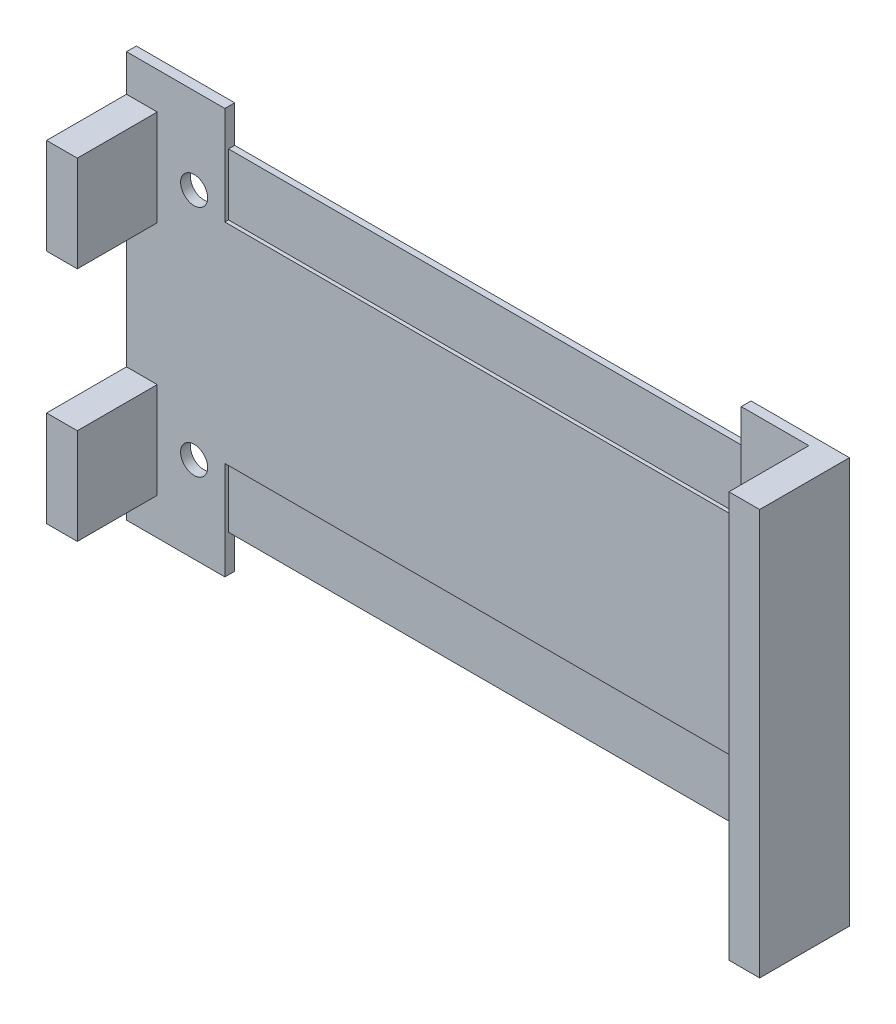
ISO-10303-21;
HEADER;
FILE_DESCRIPTION(('STEP AP214'),'2;1');
FILE_NAME('part.step','',(''),(''),'','','');
FILE_SCHEMA(('AUTOMOTIVE_DESIGN { 1 0 10303 214 1 1 1 1 }'));
ENDSEC;
DATA;
#1=APPLICATION_CONTEXT('core data for automotive mechanical design processes');
#2=APPLICATION_PROTOCOL_DEFINITION('international standard','automotive_design',2000,#1);
#3=PRODUCT_CONTEXT('',#1,'mechanical');
#4=PRODUCT('Part','Part','',(#3));
#5=PRODUCT_RELATED_PRODUCT_CATEGORY('part','',(#4));
#6=PRODUCT_DEFINITION_FORMATION('','',#4);
#7=PRODUCT_DEFINITION_CONTEXT('part definition',#1,'design');
#8=PRODUCT_DEFINITION('design','',#6,#7);
#9=PRODUCT_DEFINITION_SHAPE('','',#8);
#10=(LENGTH_UNIT() NAMED_UNIT(*) SI_UNIT(.MILLI.,.METRE.));
#11=(NAMED_UNIT(*) PLANE_ANGLE_UNIT() SI_UNIT($,.RADIAN.));
#12=(NAMED_UNIT(*) SI_UNIT($,.STERADIAN.) SOLID_ANGLE_UNIT());
#13=UNCERTAINTY_MEASURE_WITH_UNIT(LENGTH_MEASURE(1.E-05),#10,'distance_accuracy_value','');
#14=(GEOMETRIC_REPRESENTATION_CONTEXT(3) GLOBAL_UNCERTAINTY_ASSIGNED_CONTEXT((#13)) GLOBAL_UNIT_ASSIGNED_CONTEXT((#10,
#11,#12)) REPRESENTATION_CONTEXT('',''));
#15=CARTESIAN_POINT('',(0.,0.,0.));
#16=DIRECTION('',(0.,0.,1.));
#17=DIRECTION('',(1.,0.,0.));
#18=AXIS2_PLACEMENT_3D('',#15,#16,#17);
#19=CARTESIAN_POINT('',(0.,0.,-1.5));
#20=DIRECTION('',(0.,0.,-1.));
#21=DIRECTION('',(-1.,0.,0.));
#22=AXIS2_PLACEMENT_3D('',#19,#20,#21);
#23=PLANE('',#22);
#24=CARTESIAN_POINT('',(2.5,21.,-1.5));
#25=DIRECTION('',(0.,0.,1.));
#26=DIRECTION('',(1.,0.,0.));
#27=AXIS2_PLACEMENT_3D('',#24,#25,#26);
#28=CIRCLE('',#27,1.1);
#29=CARTESIAN_POINT('',(3.6,21.,-1.5));
#30=VERTEX_POINT('',#29);
#31=EDGE_CURVE('E385',#30,#30,#28,.T.);
#32=ORIENTED_EDGE('',*,*,#31,.F.);
#33=EDGE_LOOP('',(#32));
#34=FACE_BOUND('',#33,.T.);
#35=CARTESIAN_POINT('',(49.5,21.,-1.5));
#36=DIRECTION('',(0.,0.,1.));
#37=DIRECTION('',(1.,0.,0.));
#38=AXIS2_PLACEMENT_3D('',#35,#36,#37);
#39=CIRCLE('',#38,1.1);
#40=CARTESIAN_POINT('',(50.6,21.,-1.5));
#41=VERTEX_POINT('',#40);
#42=EDGE_CURVE('E401',#41,#41,#39,.T.);
#43=ORIENTED_EDGE('',*,*,#42,.F.);
#44=EDGE_LOOP('',(#43));
#45=FACE_BOUND('',#44,.T.);
#46=CARTESIAN_POINT('',(49.5,2.,-1.5));
#47=DIRECTION('',(0.,0.,1.));
#48=DIRECTION('',(1.,0.,0.));
#49=AXIS2_PLACEMENT_3D('',#46,#47,#48);
#50=CIRCLE('',#49,1.1);
#51=CARTESIAN_POINT('',(50.6,2.,-1.5));
#52=VERTEX_POINT('',#51);
#53=EDGE_CURVE('E409',#52,#52,#50,.T.);
#54=ORIENTED_EDGE('',*,*,#53,.F.);
#55=EDGE_LOOP('',(#54));
#56=FACE_BOUND('',#55,.T.);
#57=CARTESIAN_POINT('',(2.5,2.,-1.5));
#58=DIRECTION('',(0.,0.,1.));
#59=DIRECTION('',(1.,0.,0.));
#60=AXIS2_PLACEMENT_3D('',#57,#58,#59);
#61=CIRCLE('',#60,1.1);
#62=CARTESIAN_POINT('',(3.6,2.,-1.5));
#63=VERTEX_POINT('',#62);
#64=EDGE_CURVE('E393',#63,#63,#61,.T.);
#65=ORIENTED_EDGE('',*,*,#64,.F.);
#66=EDGE_LOOP('',(#65));
#67=FACE_BOUND('',#66,.T.);
#68=DIRECTION('',(1.,0.,0.));
#69=VECTOR('',#68,1.);
#70=CARTESIAN_POINT('',(-3.,17.2,-1.5));
#71=LINE('',#70,#69);
#72=CARTESIAN_POINT('',(-3.,17.2,-1.5));
#73=VERTEX_POINT('',#72);
#74=CARTESIAN_POINT('',(-0.5,17.2,-1.5));
#75=VERTEX_POINT('',#74);
#76=EDGE_CURVE('E547',#73,#75,#71,.T.);
#77=ORIENTED_EDGE('',*,*,#76,.F.);
#78=DIRECTION('',(0.,-1.,0.));
#79=VECTOR('',#78,1.);
#80=CARTESIAN_POINT('',(-3.,-5.,-1.5));
#81=LINE('',#80,#79);
#82=CARTESIAN_POINT('',(-3.,5.79999999999999,-1.5));
#83=VERTEX_POINT('',#82);
#84=EDGE_CURVE('E262',#73,#83,#81,.T.);
#85=ORIENTED_EDGE('',*,*,#84,.T.);
#86=DIRECTION('',(-1.,0.,0.));
#87=VECTOR('',#86,1.);
#88=CARTESIAN_POINT('',(-3.,5.79999999999999,-1.5));
#89=LINE('',#88,#87);
#90=CARTESIAN_POINT('',(-0.5,5.79999999999999,-1.5));
#91=VERTEX_POINT('',#90);
#92=EDGE_CURVE('E280',#91,#83,#89,.T.);
#93=ORIENTED_EDGE('',*,*,#92,.F.);
#94=DIRECTION('',(0.,1.,0.));
#95=VECTOR('',#94,1.);
#96=CARTESIAN_POINT('',(-0.5,-2.,-1.5));
#97=LINE('',#96,#95);
#98=CARTESIAN_POINT('',(-0.5,-2.,-1.5));
#99=VERTEX_POINT('',#98);
#100=EDGE_CURVE('E268',#99,#91,#97,.T.);
#101=ORIENTED_EDGE('',*,*,#100,.F.);
#102=DIRECTION('',(1.,0.,0.));
#103=VECTOR('',#102,1.);
#104=CARTESIAN_POINT('',(-3.,-2.,-1.5));
#105=LINE('',#104,#103);
#106=CARTESIAN_POINT('',(-3.,-2.,-1.5));
#107=VERTEX_POINT('',#106);
#108=EDGE_CURVE('E264',#107,#99,#105,.T.);
#109=ORIENTED_EDGE('',*,*,#108,.F.);
#110=CARTESIAN_POINT('',(-3.,-5.,-1.5));
#111=VERTEX_POINT('',#110);
#112=EDGE_CURVE('E419',#107,#111,#81,.T.);
#113=ORIENTED_EDGE('',*,*,#112,.T.);
#114=DIRECTION('',(1.,0.,0.));
#115=VECTOR('',#114,1.);
#116=CARTESIAN_POINT('',(0.,-5.,-1.5));
#117=LINE('',#116,#115);
#118=CARTESIAN_POINT('',(5.,-5.,-1.5));
#119=VERTEX_POINT('',#118);
#120=EDGE_CURVE('E424',#111,#119,#117,.T.);
#121=ORIENTED_EDGE('',*,*,#120,.T.);
#122=DIRECTION('',(0.,1.,0.));
#123=VECTOR('',#122,1.);
#124=CARTESIAN_POINT('',(5.,-5.,-1.5));
#125=LINE('',#124,#123);
#126=CARTESIAN_POINT('',(5.,2.99999999999999,-1.5));
#127=VERTEX_POINT('',#126);
#128=EDGE_CURVE('E426',#119,#127,#125,.T.);
#129=ORIENTED_EDGE('',*,*,#128,.T.);
#130=DIRECTION('',(1.,0.,0.));
#131=VECTOR('',#130,1.);
#132=CARTESIAN_POINT('',(47.,3.,-1.5));
#133=LINE('',#132,#131);
#134=CARTESIAN_POINT('',(47.,3.,-1.5));
#135=VERTEX_POINT('',#134);
#136=EDGE_CURVE('E428',#127,#135,#133,.T.);
#137=ORIENTED_EDGE('',*,*,#136,.T.);
#138=DIRECTION('',(0.,-1.,0.));
#139=VECTOR('',#138,1.);
#140=CARTESIAN_POINT('',(47.,-5.,-1.5));
#141=LINE('',#140,#139);
#142=CARTESIAN_POINT('',(47.,-5.,-1.5));
#143=VERTEX_POINT('',#142);
#144=EDGE_CURVE('E431',#135,#143,#141,.T.);
#145=ORIENTED_EDGE('',*,*,#144,.T.);
#146=DIRECTION('',(1.,0.,0.));
#147=VECTOR('',#146,1.);
#148=CARTESIAN_POINT('',(47.,-5.,-1.5));
#149=LINE('',#148,#147);
#150=CARTESIAN_POINT('',(52.5,-5.,-1.5));
#151=VERTEX_POINT('',#150);
#152=EDGE_CURVE('E433',#143,#151,#149,.T.);
#153=ORIENTED_EDGE('',*,*,#152,.T.);
#154=DIRECTION('',(0.,-1.,0.));
#155=VECTOR('',#154,1.);
#156=CARTESIAN_POINT('',(52.5,-5.,-1.5));
#157=LINE('',#156,#155);
#158=CARTESIAN_POINT('',(52.5,28.,-1.5));
#159=VERTEX_POINT('',#158);
#160=EDGE_CURVE('E309',#159,#151,#157,.T.);
#161=ORIENTED_EDGE('',*,*,#160,.F.);
#162=DIRECTION('',(-1.,0.,0.));
#163=VECTOR('',#162,1.);
#164=CARTESIAN_POINT('',(55.,28.,-1.5));
#165=LINE('',#164,#163);
#166=CARTESIAN_POINT('',(47.,28.,-1.5));
#167=VERTEX_POINT('',#166);
#168=EDGE_CURVE('E333',#159,#167,#165,.T.);
#169=ORIENTED_EDGE('',*,*,#168,.T.);
#170=DIRECTION('',(0.,-1.,0.));
#171=VECTOR('',#170,1.);
#172=CARTESIAN_POINT('',(47.,28.,-1.5));
#173=LINE('',#172,#171);
#174=CARTESIAN_POINT('',(47.,20.,-1.5));
#175=VERTEX_POINT('',#174);
#176=EDGE_CURVE('E504',#167,#175,#173,.T.);
#177=ORIENTED_EDGE('',*,*,#176,.T.);
#178=DIRECTION('',(-1.,0.,0.));
#179=VECTOR('',#178,1.);
#180=CARTESIAN_POINT('',(5.00000000000001,20.,-1.5));
#181=LINE('',#180,#179);
#182=CARTESIAN_POINT('',(5.00000000000001,20.,-1.5));
#183=VERTEX_POINT('',#182);
#184=EDGE_CURVE('E502',#175,#183,#181,.T.);
#185=ORIENTED_EDGE('',*,*,#184,.T.);
#186=DIRECTION('',(0.,1.,0.));
#187=VECTOR('',#186,1.);
#188=CARTESIAN_POINT('',(5.,28.,-1.5));
#189=LINE('',#188,#187);
#190=CARTESIAN_POINT('',(5.,28.,-1.5));
#191=VERTEX_POINT('',#190);
#192=EDGE_CURVE('E473',#183,#191,#189,.T.);
#193=ORIENTED_EDGE('',*,*,#192,.T.);
#194=DIRECTION('',(-1.,0.,0.));
#195=VECTOR('',#194,1.);
#196=CARTESIAN_POINT('',(-3.,28.,-1.5));
#197=LINE('',#196,#195);
#198=CARTESIAN_POINT('',(-3.,28.,-1.5));
#199=VERTEX_POINT('',#198);
#200=EDGE_CURVE('E415',#191,#199,#197,.T.);
#201=ORIENTED_EDGE('',*,*,#200,.T.);
#202=CARTESIAN_POINT('',(-3.,25.,-1.5));
#203=VERTEX_POINT('',#202);
#204=EDGE_CURVE('E421',#199,#203,#81,.T.);
#205=ORIENTED_EDGE('',*,*,#204,.T.);
#206=DIRECTION('',(-1.,0.,0.));
#207=VECTOR('',#206,1.);
#208=CARTESIAN_POINT('',(-3.,25.,-1.5));
#209=LINE('',#208,#207);
#210=CARTESIAN_POINT('',(-0.5,25.,-1.5));
#211=VERTEX_POINT('',#210);
#212=EDGE_CURVE('E66',#211,#203,#209,.T.);
#213=ORIENTED_EDGE('',*,*,#212,.F.);
#214=DIRECTION('',(0.,1.,0.));
#215=VECTOR('',#214,1.);
#216=CARTESIAN_POINT('',(-0.5,17.2,-1.5));
#217=LINE('',#216,#215);
#218=EDGE_CURVE('E59',#75,#211,#217,.T.);
#219=ORIENTED_EDGE('',*,*,#218,.F.);
#220=EDGE_LOOP('',(#77,#85,#93,#101,#109,#113,#121,#129,#137,#145,#153,#161,#169,#177,#185,#193,
#201,#205,#213,#219));
#221=FACE_BOUND('',#220,.T.);
#222=ADVANCED_FACE('F39',(#34,#45,#56,#67,#221),#23,.F.);
#223=CARTESIAN_POINT('',(5.,-5.,-1.5));
#224=DIRECTION('',(-1.,0.,0.));
#225=DIRECTION('',(0.,0.,1.));
#226=AXIS2_PLACEMENT_3D('',#223,#224,#225);
#227=PLANE('',#226);
#228=DIRECTION('',(0.,0.,-1.));
#229=VECTOR('',#228,1.);
#230=CARTESIAN_POINT('',(5.,-2.,-1.80000000000001));
#231=LINE('',#230,#229);
#232=CARTESIAN_POINT('',(5.,-2.,-1.80000000000001));
#233=VERTEX_POINT('',#232);
#234=CARTESIAN_POINT('',(5.,-2.,-2.30000000000001));
#235=VERTEX_POINT('',#234);
#236=EDGE_CURVE('E374',#233,#235,#231,.T.);
#237=ORIENTED_EDGE('',*,*,#236,.F.);
#238=DIRECTION('',(0.,-1.,0.));
#239=VECTOR('',#238,1.);
#240=CARTESIAN_POINT('',(5.,-2.,-1.80000000000001));
#241=LINE('',#240,#239);
#242=CARTESIAN_POINT('',(5.,2.99999999999999,-1.80000000000001));
#243=VERTEX_POINT('',#242);
#244=EDGE_CURVE('E357',#243,#233,#241,.T.);
#245=ORIENTED_EDGE('',*,*,#244,.F.);
#246=DIRECTION('',(0.,0.,-1.));
#247=VECTOR('',#246,1.);
#248=CARTESIAN_POINT('',(5.,2.99999999999999,-1.5));
#249=LINE('',#248,#247);
#250=EDGE_CURVE('E443',#127,#243,#249,.T.);
#251=ORIENTED_EDGE('',*,*,#250,.F.);
#252=ORIENTED_EDGE('',*,*,#128,.F.);
#253=DIRECTION('',(0.,0.,-1.));
#254=VECTOR('',#253,1.);
#255=CARTESIAN_POINT('',(5.,-5.,-1.5));
#256=LINE('',#255,#254);
#257=CARTESIAN_POINT('',(5.,-5.,-2.30000000000001));
#258=VERTEX_POINT('',#257);
#259=EDGE_CURVE('E440',#119,#258,#256,.T.);
#260=ORIENTED_EDGE('',*,*,#259,.T.);
#261=DIRECTION('',(0.,1.,0.));
#262=VECTOR('',#261,1.);
#263=CARTESIAN_POINT('',(5.,-5.,-2.30000000000001));
#264=LINE('',#263,#262);
#265=EDGE_CURVE('E493',#258,#235,#264,.T.);
#266=ORIENTED_EDGE('',*,*,#265,.T.);
#267=EDGE_LOOP('',(#237,#245,#251,#252,#260,#266));
#268=FACE_BOUND('',#267,.T.);
#269=ADVANCED_FACE('F592',(#268),#227,.F.);
#270=CARTESIAN_POINT('',(47.,3.,-1.5));
#271=DIRECTION('',(0.,1.,0.));
#272=DIRECTION('',(-1.,0.,0.));
#273=AXIS2_PLACEMENT_3D('',#270,#271,#272);
#274=PLANE('',#273);
#275=DIRECTION('',(-1.,0.,0.));
#276=VECTOR('',#275,1.);
#277=CARTESIAN_POINT('',(47.,3.,-1.80000000000001));
#278=LINE('',#277,#276);
#279=CARTESIAN_POINT('',(47.,3.,-1.80000000000001));
#280=VERTEX_POINT('',#279);
#281=EDGE_CURVE('E380',#280,#243,#278,.T.);
#282=ORIENTED_EDGE('',*,*,#281,.F.);
#283=DIRECTION('',(0.,0.,-1.));
#284=VECTOR('',#283,1.);
#285=CARTESIAN_POINT('',(47.,3.,-1.5));
#286=LINE('',#285,#284);
#287=EDGE_CURVE('E446',#135,#280,#286,.T.);
#288=ORIENTED_EDGE('',*,*,#287,.F.);
#289=ORIENTED_EDGE('',*,*,#136,.F.);
#290=ORIENTED_EDGE('',*,*,#250,.T.);
#291=EDGE_LOOP('',(#282,#288,#289,#290));
#292=FACE_BOUND('',#291,.T.);
#293=ADVANCED_FACE('F628',(#292),#274,.F.);
#294=CARTESIAN_POINT('',(47.,-5.,-1.5));
#295=DIRECTION('',(1.,0.,0.));
#296=DIRECTION('',(0.,0.,-1.));
#297=AXIS2_PLACEMENT_3D('',#294,#295,#296);
#298=PLANE('',#297);
#299=DIRECTION('',(0.,0.,-1.));
#300=VECTOR('',#299,1.);
#301=CARTESIAN_POINT('',(47.,-2.,-1.80000000000001));
#302=LINE('',#301,#300);
#303=CARTESIAN_POINT('',(47.,-2.,-1.80000000000001));
#304=VERTEX_POINT('',#303);
#305=CARTESIAN_POINT('',(47.,-2.,-2.30000000000001));
#306=VERTEX_POINT('',#305);
#307=EDGE_CURVE('E371',#304,#306,#302,.T.);
#308=ORIENTED_EDGE('',*,*,#307,.T.);
#309=DIRECTION('',(0.,-1.,0.));
#310=VECTOR('',#309,1.);
#311=CARTESIAN_POINT('',(47.,-5.,-2.30000000000001));
#312=LINE('',#311,#310);
#313=CARTESIAN_POINT('',(47.,-5.,-2.30000000000001));
#314=VERTEX_POINT('',#313);
#315=EDGE_CURVE('E491',#306,#314,#312,.T.);
#316=ORIENTED_EDGE('',*,*,#315,.T.);
#317=DIRECTION('',(0.,0.,-1.));
#318=VECTOR('',#317,1.);
#319=CARTESIAN_POINT('',(47.,-5.,-1.5));
#320=LINE('',#319,#318);
#321=EDGE_CURVE('E449',#143,#314,#320,.T.);
#322=ORIENTED_EDGE('',*,*,#321,.F.);
#323=ORIENTED_EDGE('',*,*,#144,.F.);
#324=ORIENTED_EDGE('',*,*,#287,.T.);
#325=DIRECTION('',(0.,1.,0.));
#326=VECTOR('',#325,1.);
#327=CARTESIAN_POINT('',(47.,-2.,-1.80000000000001));
#328=LINE('',#327,#326);
#329=EDGE_CURVE('E554',#304,#280,#328,.T.);
#330=ORIENTED_EDGE('',*,*,#329,.F.);
#331=EDGE_LOOP('',(#308,#316,#322,#323,#324,#330));
#332=FACE_BOUND('',#331,.T.);
#333=ADVANCED_FACE('F569',(#332),#298,.F.);
#334=CARTESIAN_POINT('',(47.,28.,-1.5));
#335=DIRECTION('',(1.,0.,0.));
#336=DIRECTION('',(0.,0.,-1.));
#337=AXIS2_PLACEMENT_3D('',#334,#335,#336);
#338=PLANE('',#337);
#339=DIRECTION('',(0.,0.,-1.));
#340=VECTOR('',#339,1.);
#341=CARTESIAN_POINT('',(47.,25.,-1.80000000000001));
#342=LINE('',#341,#340);
#343=CARTESIAN_POINT('',(47.,25.,-1.80000000000001));
#344=VERTEX_POINT('',#343);
#345=CARTESIAN_POINT('',(47.,25.,-2.30000000000001));
#346=VERTEX_POINT('',#345);
#347=EDGE_CURVE('E367',#344,#346,#342,.T.);
#348=ORIENTED_EDGE('',*,*,#347,.F.);
#349=CARTESIAN_POINT('',(47.,20.,-1.80000000000001));
#350=VERTEX_POINT('',#349);
#351=EDGE_CURVE('E518',#350,#344,#328,.T.);
#352=ORIENTED_EDGE('',*,*,#351,.F.);
#353=DIRECTION('',(0.,0.,-1.));
#354=VECTOR('',#353,1.);
#355=CARTESIAN_POINT('',(47.,20.,-1.5));
#356=LINE('',#355,#354);
#357=EDGE_CURVE('E463',#175,#350,#356,.T.);
#358=ORIENTED_EDGE('',*,*,#357,.F.);
#359=ORIENTED_EDGE('',*,*,#176,.F.);
#360=DIRECTION('',(0.,0.,-1.));
#361=VECTOR('',#360,1.);
#362=CARTESIAN_POINT('',(47.,28.,-1.5));
#363=LINE('',#362,#361);
#364=CARTESIAN_POINT('',(47.,28.,-2.30000000000001));
#365=VERTEX_POINT('',#364);
#366=EDGE_CURVE('E459',#167,#365,#363,.T.);
#367=ORIENTED_EDGE('',*,*,#366,.T.);
#368=DIRECTION('',(0.,-1.,0.));
#369=VECTOR('',#368,1.);
#370=CARTESIAN_POINT('',(47.,28.,-2.30000000000001));
#371=LINE('',#370,#369);
#372=EDGE_CURVE('E479',#365,#346,#371,.T.);
#373=ORIENTED_EDGE('',*,*,#372,.T.);
#374=EDGE_LOOP('',(#348,#352,#358,#359,#367,#373));
#375=FACE_BOUND('',#374,.T.);
#376=ADVANCED_FACE('F515',(#375),#338,.F.);
#377=CARTESIAN_POINT('',(5.00000000000001,20.,-1.5));
#378=DIRECTION('',(0.,-1.,0.));
#379=DIRECTION('',(0.,0.,-1.));
#380=AXIS2_PLACEMENT_3D('',#377,#378,#379);
#381=PLANE('',#380);
#382=DIRECTION('',(1.,0.,0.));
#383=VECTOR('',#382,1.);
#384=CARTESIAN_POINT('',(5.00000000000001,20.,-1.80000000000001));
#385=LINE('',#384,#383);
#386=CARTESIAN_POINT('',(5.00000000000001,20.,-1.80000000000001));
#387=VERTEX_POINT('',#386);
#388=EDGE_CURVE('E376',#387,#350,#385,.T.);
#389=ORIENTED_EDGE('',*,*,#388,.F.);
#390=DIRECTION('',(0.,0.,-1.));
#391=VECTOR('',#390,1.);
#392=CARTESIAN_POINT('',(5.00000000000001,20.,-1.5));
#393=LINE('',#392,#391);
#394=EDGE_CURVE('E466',#183,#387,#393,.T.);
#395=ORIENTED_EDGE('',*,*,#394,.F.);
#396=ORIENTED_EDGE('',*,*,#184,.F.);
#397=ORIENTED_EDGE('',*,*,#357,.T.);
#398=EDGE_LOOP('',(#389,#395,#396,#397));
#399=FACE_BOUND('',#398,.T.);
#400=ADVANCED_FACE('F521',(#399),#381,.F.);
#401=CARTESIAN_POINT('',(5.,28.,-1.5));
#402=DIRECTION('',(-1.,0.,0.));
#403=DIRECTION('',(0.,-1.,0.));
#404=AXIS2_PLACEMENT_3D('',#401,#402,#403);
#405=PLANE('',#404);
#406=DIRECTION('',(0.,0.,-1.));
#407=VECTOR('',#406,1.);
#408=CARTESIAN_POINT('',(5.00000000000001,25.,-1.80000000000001));
#409=LINE('',#408,#407);
#410=CARTESIAN_POINT('',(5.00000000000001,25.,-1.80000000000001));
#411=VERTEX_POINT('',#410);
#412=CARTESIAN_POINT('',(5.00000000000001,25.,-2.30000000000001));
#413=VERTEX_POINT('',#412);
#414=EDGE_CURVE('E363',#411,#413,#409,.T.);
#415=ORIENTED_EDGE('',*,*,#414,.T.);
#416=DIRECTION('',(0.,1.,0.));
#417=VECTOR('',#416,1.);
#418=CARTESIAN_POINT('',(5.,28.,-2.30000000000001));
#419=LINE('',#418,#417);
#420=CARTESIAN_POINT('',(5.,28.,-2.30000000000001));
#421=VERTEX_POINT('',#420);
#422=EDGE_CURVE('E476',#413,#421,#419,.T.);
#423=ORIENTED_EDGE('',*,*,#422,.T.);
#424=DIRECTION('',(0.,0.,-1.));
#425=VECTOR('',#424,1.);
#426=CARTESIAN_POINT('',(5.,28.,-1.5));
#427=LINE('',#426,#425);
#428=EDGE_CURVE('E469',#191,#421,#427,.T.);
#429=ORIENTED_EDGE('',*,*,#428,.F.);
#430=ORIENTED_EDGE('',*,*,#192,.F.);
#431=ORIENTED_EDGE('',*,*,#394,.T.);
#432=EDGE_CURVE('E326',#411,#387,#241,.T.);
#433=ORIENTED_EDGE('',*,*,#432,.F.);
#434=EDGE_LOOP('',(#415,#423,#429,#430,#431,#433));
#435=FACE_BOUND('',#434,.T.);
#436=ADVANCED_FACE('F526',(#435),#405,.F.);
#437=CARTESIAN_POINT('',(0.,0.,-2.30000000000001));
#438=DIRECTION('',(0.,0.,-1.));
#439=DIRECTION('',(-1.,0.,0.));
#440=AXIS2_PLACEMENT_3D('',#437,#438,#439);
#441=PLANE('',#440);
#442=DIRECTION('',(1.,0.,0.));
#443=VECTOR('',#442,1.);
#444=CARTESIAN_POINT('',(5.,-2.,-2.30000000000001));
#445=LINE('',#444,#443);
#446=EDGE_CURVE('E342',#235,#306,#445,.T.);
#447=ORIENTED_EDGE('',*,*,#446,.F.);
#448=ORIENTED_EDGE('',*,*,#265,.F.);
#449=DIRECTION('',(1.,0.,0.));
#450=VECTOR('',#449,1.);
#451=CARTESIAN_POINT('',(0.,-5.,-2.30000000000001));
#452=LINE('',#451,#450);
#453=CARTESIAN_POINT('',(-3.,-5.,-2.30000000000001));
#454=VERTEX_POINT('',#453);
#455=EDGE_CURVE('E495',#454,#258,#452,.T.);
#456=ORIENTED_EDGE('',*,*,#455,.F.);
#457=DIRECTION('',(0.,-1.,0.));
#458=VECTOR('',#457,1.);
#459=CARTESIAN_POINT('',(-3.,-5.,-2.30000000000001));
#460=LINE('',#459,#458);
#461=CARTESIAN_POINT('',(-3.,28.,-2.30000000000001));
#462=VERTEX_POINT('',#461);
#463=EDGE_CURVE('E412',#462,#454,#460,.T.);
#464=ORIENTED_EDGE('',*,*,#463,.F.);
#465=DIRECTION('',(-1.,0.,0.));
#466=VECTOR('',#465,1.);
#467=CARTESIAN_POINT('',(0.,28.,-2.30000000000001));
#468=LINE('',#467,#466);
#469=EDGE_CURVE('E420',#421,#462,#468,.T.);
#470=ORIENTED_EDGE('',*,*,#469,.F.);
#471=ORIENTED_EDGE('',*,*,#422,.F.);
#472=DIRECTION('',(-1.,0.,0.));
#473=VECTOR('',#472,1.);
#474=CARTESIAN_POINT('',(5.00000000000001,25.,-2.30000000000001));
#475=LINE('',#474,#473);
#476=EDGE_CURVE('E348',#346,#413,#475,.T.);
#477=ORIENTED_EDGE('',*,*,#476,.F.);
#478=ORIENTED_EDGE('',*,*,#372,.F.);
#479=DIRECTION('',(-1.,0.,0.));
#480=VECTOR('',#479,1.);
#481=CARTESIAN_POINT('',(47.,28.,-2.30000000000001));
#482=LINE('',#481,#480);
#483=CARTESIAN_POINT('',(55.,28.,-2.30000000000001));
#484=VERTEX_POINT('',#483);
#485=EDGE_CURVE('E482',#484,#365,#482,.T.);
#486=ORIENTED_EDGE('',*,*,#485,.F.);
#487=DIRECTION('',(0.,1.,0.));
#488=VECTOR('',#487,1.);
#489=CARTESIAN_POINT('',(55.,-5.,-2.30000000000001));
#490=LINE('',#489,#488);
#491=CARTESIAN_POINT('',(55.,-5.,-2.30000000000001));
#492=VERTEX_POINT('',#491);
#493=EDGE_CURVE('E485',#492,#484,#490,.T.);
#494=ORIENTED_EDGE('',*,*,#493,.F.);
#495=DIRECTION('',(1.,0.,0.));
#496=VECTOR('',#495,1.);
#497=CARTESIAN_POINT('',(52.,-5.,-2.30000000000001));
#498=LINE('',#497,#496);
#499=EDGE_CURVE('E489',#314,#492,#498,.T.);
#500=ORIENTED_EDGE('',*,*,#499,.F.);
#501=ORIENTED_EDGE('',*,*,#315,.F.);
#502=EDGE_LOOP('',(#447,#448,#456,#464,#470,#471,#477,#478,#486,#494,#500,#501));
#503=FACE_BOUND('',#502,.T.);
#504=CARTESIAN_POINT('',(2.5,21.,-2.30000000000001));
#505=DIRECTION('',(0.,0.,1.));
#506=DIRECTION('',(1.,0.,0.));
#507=AXIS2_PLACEMENT_3D('',#504,#505,#506);
#508=CIRCLE('',#507,1.1);
#509=CARTESIAN_POINT('',(3.6,21.,-2.30000000000001));
#510=VERTEX_POINT('',#509);
#511=EDGE_CURVE('E384',#510,#510,#508,.T.);
#512=ORIENTED_EDGE('',*,*,#511,.T.);
#513=EDGE_LOOP('',(#512));
#514=FACE_BOUND('',#513,.T.);
#515=CARTESIAN_POINT('',(2.5,2.,-2.30000000000001));
#516=DIRECTION('',(0.,0.,1.));
#517=DIRECTION('',(1.,0.,0.));
#518=AXIS2_PLACEMENT_3D('',#515,#516,#517);
#519=CIRCLE('',#518,1.1);
#520=CARTESIAN_POINT('',(3.6,2.,-2.30000000000001));
#521=VERTEX_POINT('',#520);
#522=EDGE_CURVE('E389',#521,#521,#519,.T.);
#523=ORIENTED_EDGE('',*,*,#522,.T.);
#524=EDGE_LOOP('',(#523));
#525=FACE_BOUND('',#524,.T.);
#526=CARTESIAN_POINT('',(49.5,21.,-2.30000000000001));
#527=DIRECTION('',(0.,0.,1.));
#528=DIRECTION('',(1.,0.,0.));
#529=AXIS2_PLACEMENT_3D('',#526,#527,#528);
#530=CIRCLE('',#529,1.1);
#531=CARTESIAN_POINT('',(50.6,21.,-2.30000000000001));
#532=VERTEX_POINT('',#531);
#533=EDGE_CURVE('E397',#532,#532,#530,.T.);
#534=ORIENTED_EDGE('',*,*,#533,.T.);
#535=EDGE_LOOP('',(#534));
#536=FACE_BOUND('',#535,.T.);
#537=CARTESIAN_POINT('',(49.5,2.,-2.30000000000001));
#538=DIRECTION('',(0.,0.,1.));
#539=DIRECTION('',(1.,0.,0.));
#540=AXIS2_PLACEMENT_3D('',#537,#538,#539);
#541=CIRCLE('',#540,1.1);
#542=CARTESIAN_POINT('',(50.6,2.,-2.30000000000001));
#543=VERTEX_POINT('',#542);
#544=EDGE_CURVE('E405',#543,#543,#541,.T.);
#545=ORIENTED_EDGE('',*,*,#544,.T.);
#546=EDGE_LOOP('',(#545));
#547=FACE_BOUND('',#546,.T.);
#548=ADVANCED_FACE('F532',(#503,#514,#525,#536,#547),#441,.T.);
#549=CARTESIAN_POINT('',(-3.,-5.,-1.5));
#550=DIRECTION('',(1.,0.,0.));
#551=DIRECTION('',(0.,0.,-1.));
#552=AXIS2_PLACEMENT_3D('',#549,#550,#551);
#553=PLANE('',#552);
#554=ORIENTED_EDGE('',*,*,#463,.T.);
#555=DIRECTION('',(0.,0.,-1.));
#556=VECTOR('',#555,1.);
#557=CARTESIAN_POINT('',(-3.,-5.,-1.5));
#558=LINE('',#557,#556);
#559=EDGE_CURVE('E48',#111,#454,#558,.T.);
#560=ORIENTED_EDGE('',*,*,#559,.F.);
#561=ORIENTED_EDGE('',*,*,#112,.F.);
#562=DIRECTION('',(0.,0.,-1.));
#563=VECTOR('',#562,1.);
#564=CARTESIAN_POINT('',(-3.,-2.,5.));
#565=LINE('',#564,#563);
#566=CARTESIAN_POINT('',(-3.,-2.,5.));
#567=VERTEX_POINT('',#566);
#568=EDGE_CURVE('E306',#567,#107,#565,.T.);
#569=ORIENTED_EDGE('',*,*,#568,.F.);
#570=DIRECTION('',(0.,-1.,0.));
#571=VECTOR('',#570,1.);
#572=CARTESIAN_POINT('',(-3.,-2.,5.));
#573=LINE('',#572,#571);
#574=CARTESIAN_POINT('',(-3.,5.79999999999999,5.));
#575=VERTEX_POINT('',#574);
#576=EDGE_CURVE('E275',#575,#567,#573,.T.);
#577=ORIENTED_EDGE('',*,*,#576,.F.);
#578=DIRECTION('',(0.,0.,-1.));
#579=VECTOR('',#578,1.);
#580=CARTESIAN_POINT('',(-3.,5.79999999999999,5.));
#581=LINE('',#580,#579);
#582=EDGE_CURVE('E288',#575,#83,#581,.T.);
#583=ORIENTED_EDGE('',*,*,#582,.T.);
#584=ORIENTED_EDGE('',*,*,#84,.F.);
#585=DIRECTION('',(0.,0.,-1.));
#586=VECTOR('',#585,1.);
#587=CARTESIAN_POINT('',(-3.,17.2,5.));
#588=LINE('',#587,#586);
#589=CARTESIAN_POINT('',(-3.,17.2,5.));
#590=VERTEX_POINT('',#589);
#591=EDGE_CURVE('E242',#590,#73,#588,.T.);
#592=ORIENTED_EDGE('',*,*,#591,.F.);
#593=DIRECTION('',(0.,-1.,0.));
#594=VECTOR('',#593,1.);
#595=CARTESIAN_POINT('',(-3.,17.2,5.));
#596=LINE('',#595,#594);
#597=CARTESIAN_POINT('',(-3.,25.,5.));
#598=VERTEX_POINT('',#597);
#599=EDGE_CURVE('E249',#598,#590,#596,.T.);
#600=ORIENTED_EDGE('',*,*,#599,.F.);
#601=DIRECTION('',(0.,0.,-1.));
#602=VECTOR('',#601,1.);
#603=CARTESIAN_POINT('',(-3.,25.,5.));
#604=LINE('',#603,#602);
#605=EDGE_CURVE('E537',#598,#203,#604,.T.);
#606=ORIENTED_EDGE('',*,*,#605,.T.);
#607=ORIENTED_EDGE('',*,*,#204,.F.);
#608=DIRECTION('',(0.,0.,-1.));
#609=VECTOR('',#608,1.);
#610=CARTESIAN_POINT('',(-3.,28.,-1.5));
#611=LINE('',#610,#609);
#612=EDGE_CURVE('E11',#199,#462,#611,.T.);
#613=ORIENTED_EDGE('',*,*,#612,.T.);
#614=EDGE_LOOP('',(#554,#560,#561,#569,#577,#583,#584,#592,#600,#606,#607,#613));
#615=FACE_BOUND('',#614,.T.);
#616=ADVANCED_FACE('F41',(#615),#553,.F.);
#617=CARTESIAN_POINT('',(0.,-5.,-1.5));
#618=DIRECTION('',(0.,1.,0.));
#619=DIRECTION('',(-1.,0.,0.));
#620=AXIS2_PLACEMENT_3D('',#617,#618,#619);
#621=PLANE('',#620);
#622=ORIENTED_EDGE('',*,*,#455,.T.);
#623=ORIENTED_EDGE('',*,*,#259,.F.);
#624=ORIENTED_EDGE('',*,*,#120,.F.);
#625=ORIENTED_EDGE('',*,*,#559,.T.);
#626=EDGE_LOOP('',(#622,#623,#624,#625));
#627=FACE_BOUND('',#626,.T.);
#628=ADVANCED_FACE('F597',(#627),#621,.F.);
#629=CARTESIAN_POINT('',(52.,-5.,-1.5));
#630=DIRECTION('',(0.,1.,0.));
#631=DIRECTION('',(-1.,0.,0.));
#632=AXIS2_PLACEMENT_3D('',#629,#630,#631);
#633=PLANE('',#632);
#634=ORIENTED_EDGE('',*,*,#499,.T.);
#635=DIRECTION('',(0.,0.,-1.));
#636=VECTOR('',#635,1.);
#637=CARTESIAN_POINT('',(55.,-5.,-1.5));
#638=LINE('',#637,#636);
#639=CARTESIAN_POINT('',(55.,-5.,5.));
#640=VERTEX_POINT('',#639);
#641=EDGE_CURVE('E452',#640,#492,#638,.T.);
#642=ORIENTED_EDGE('',*,*,#641,.F.);
#643=DIRECTION('',(1.,0.,0.));
#644=VECTOR('',#643,1.);
#645=CARTESIAN_POINT('',(55.,-5.,5.));
#646=LINE('',#645,#644);
#647=CARTESIAN_POINT('',(52.5,-5.,5.));
#648=VERTEX_POINT('',#647);
#649=EDGE_CURVE('E320',#648,#640,#646,.T.);
#650=ORIENTED_EDGE('',*,*,#649,.F.);
#651=DIRECTION('',(0.,0.,-1.));
#652=VECTOR('',#651,1.);
#653=CARTESIAN_POINT('',(52.5,-5.,5.));
#654=LINE('',#653,#652);
#655=EDGE_CURVE('E323',#648,#151,#654,.T.);
#656=ORIENTED_EDGE('',*,*,#655,.T.);
#657=ORIENTED_EDGE('',*,*,#152,.F.);
#658=ORIENTED_EDGE('',*,*,#321,.T.);
#659=EDGE_LOOP('',(#634,#642,#650,#656,#657,#658));
#660=FACE_BOUND('',#659,.T.);
#661=ADVANCED_FACE('F590',(#660),#633,.F.);
#662=CARTESIAN_POINT('',(55.,-5.,-1.5));
#663=DIRECTION('',(-1.,0.,0.));
#664=DIRECTION('',(0.,0.,1.));
#665=AXIS2_PLACEMENT_3D('',#662,#663,#664);
#666=PLANE('',#665);
#667=ORIENTED_EDGE('',*,*,#493,.T.);
#668=DIRECTION('',(0.,0.,-1.));
#669=VECTOR('',#668,1.);
#670=CARTESIAN_POINT('',(55.,28.,-1.5));
#671=LINE('',#670,#669);
#672=CARTESIAN_POINT('',(55.,28.,5.));
#673=VERTEX_POINT('',#672);
#674=EDGE_CURVE('E455',#673,#484,#671,.T.);
#675=ORIENTED_EDGE('',*,*,#674,.F.);
#676=DIRECTION('',(0.,1.,0.));
#677=VECTOR('',#676,1.);
#678=CARTESIAN_POINT('',(55.,-5.,5.));
#679=LINE('',#678,#677);
#680=EDGE_CURVE('E310',#640,#673,#679,.T.);
#681=ORIENTED_EDGE('',*,*,#680,.F.);
#682=ORIENTED_EDGE('',*,*,#641,.T.);
#683=EDGE_LOOP('',(#667,#675,#681,#682));
#684=FACE_BOUND('',#683,.T.);
#685=ADVANCED_FACE('F582',(#684),#666,.F.);
#686=CARTESIAN_POINT('',(47.,28.,-1.5));
#687=DIRECTION('',(0.,-1.,0.));
#688=DIRECTION('',(0.,0.,-1.));
#689=AXIS2_PLACEMENT_3D('',#686,#687,#688);
#690=PLANE('',#689);
#691=ORIENTED_EDGE('',*,*,#485,.T.);
#692=ORIENTED_EDGE('',*,*,#366,.F.);
#693=ORIENTED_EDGE('',*,*,#168,.F.);
#694=DIRECTION('',(0.,0.,-1.));
#695=VECTOR('',#694,1.);
#696=CARTESIAN_POINT('',(52.5,28.,5.));
#697=LINE('',#696,#695);
#698=CARTESIAN_POINT('',(52.5,28.,5.));
#699=VERTEX_POINT('',#698);
#700=EDGE_CURVE('E338',#699,#159,#697,.T.);
#701=ORIENTED_EDGE('',*,*,#700,.F.);
#702=DIRECTION('',(-1.,0.,0.));
#703=VECTOR('',#702,1.);
#704=CARTESIAN_POINT('',(55.,28.,5.));
#705=LINE('',#704,#703);
#706=EDGE_CURVE('E314',#673,#699,#705,.T.);
#707=ORIENTED_EDGE('',*,*,#706,.F.);
#708=ORIENTED_EDGE('',*,*,#674,.T.);
#709=EDGE_LOOP('',(#691,#692,#693,#701,#707,#708));
#710=FACE_BOUND('',#709,.T.);
#711=ADVANCED_FACE('F512',(#710),#690,.F.);
#712=CARTESIAN_POINT('',(0.,28.,-1.5));
#713=DIRECTION('',(0.,-1.,0.));
#714=DIRECTION('',(0.,0.,-1.));
#715=AXIS2_PLACEMENT_3D('',#712,#713,#714);
#716=PLANE('',#715);
#717=ORIENTED_EDGE('',*,*,#469,.T.);
#718=ORIENTED_EDGE('',*,*,#612,.F.);
#719=ORIENTED_EDGE('',*,*,#200,.F.);
#720=ORIENTED_EDGE('',*,*,#428,.T.);
#721=EDGE_LOOP('',(#717,#718,#719,#720));
#722=FACE_BOUND('',#721,.T.);
#723=ADVANCED_FACE('F529',(#722),#716,.F.);
#724=CARTESIAN_POINT('',(49.5,2.,-1.5));
#725=DIRECTION('',(0.,0.,-1.));
#726=DIRECTION('',(-1.,0.,0.));
#727=AXIS2_PLACEMENT_3D('',#724,#725,#726);
#728=CYLINDRICAL_SURFACE('',#727,1.1);
#729=ORIENTED_EDGE('',*,*,#53,.T.);
#730=EDGE_LOOP('',(#729));
#731=FACE_BOUND('',#730,.T.);
#732=ORIENTED_EDGE('',*,*,#544,.F.);
#733=EDGE_LOOP('',(#732));
#734=FACE_BOUND('',#733,.T.);
#735=ADVANCED_FACE('F634',(#731,#734),#728,.F.);
#736=CARTESIAN_POINT('',(49.5,21.,-1.5));
#737=DIRECTION('',(0.,0.,-1.));
#738=DIRECTION('',(-1.,0.,0.));
#739=AXIS2_PLACEMENT_3D('',#736,#737,#738);
#740=CYLINDRICAL_SURFACE('',#739,1.1);
#741=ORIENTED_EDGE('',*,*,#42,.T.);
#742=EDGE_LOOP('',(#741));
#743=FACE_BOUND('',#742,.T.);
#744=ORIENTED_EDGE('',*,*,#533,.F.);
#745=EDGE_LOOP('',(#744));
#746=FACE_BOUND('',#745,.T.);
#747=ADVANCED_FACE('F713',(#743,#746),#740,.F.);
#748=CARTESIAN_POINT('',(2.5,2.,-1.5));
#749=DIRECTION('',(0.,0.,-1.));
#750=DIRECTION('',(-1.,0.,0.));
#751=AXIS2_PLACEMENT_3D('',#748,#749,#750);
#752=CYLINDRICAL_SURFACE('',#751,1.1);
#753=ORIENTED_EDGE('',*,*,#64,.T.);
#754=EDGE_LOOP('',(#753));
#755=FACE_BOUND('',#754,.T.);
#756=ORIENTED_EDGE('',*,*,#522,.F.);
#757=EDGE_LOOP('',(#756));
#758=FACE_BOUND('',#757,.T.);
#759=ADVANCED_FACE('F702',(#755,#758),#752,.F.);
#760=CARTESIAN_POINT('',(2.5,21.,-1.5));
#761=DIRECTION('',(0.,0.,-1.));
#762=DIRECTION('',(-1.,0.,0.));
#763=AXIS2_PLACEMENT_3D('',#760,#761,#762);
#764=CYLINDRICAL_SURFACE('',#763,1.1);
#765=ORIENTED_EDGE('',*,*,#31,.T.);
#766=EDGE_LOOP('',(#765));
#767=FACE_BOUND('',#766,.T.);
#768=ORIENTED_EDGE('',*,*,#511,.F.);
#769=EDGE_LOOP('',(#768));
#770=FACE_BOUND('',#769,.T.);
#771=ADVANCED_FACE('F697',(#767,#770),#764,.F.);
#772=CARTESIAN_POINT('',(0.,0.,-1.80000000000001));
#773=DIRECTION('',(0.,0.,-1.));
#774=DIRECTION('',(-1.,0.,0.));
#775=AXIS2_PLACEMENT_3D('',#772,#773,#774);
#776=PLANE('',#775);
#777=ORIENTED_EDGE('',*,*,#432,.T.);
#778=ORIENTED_EDGE('',*,*,#388,.T.);
#779=ORIENTED_EDGE('',*,*,#351,.T.);
#780=DIRECTION('',(-1.,0.,0.));
#781=VECTOR('',#780,1.);
#782=CARTESIAN_POINT('',(5.00000000000001,25.,-1.80000000000001));
#783=LINE('',#782,#781);
#784=EDGE_CURVE('E360',#344,#411,#783,.T.);
#785=ORIENTED_EDGE('',*,*,#784,.T.);
#786=EDGE_LOOP('',(#777,#778,#779,#785));
#787=FACE_BOUND('',#786,.T.);
#788=ADVANCED_FACE('F576',(#787),#776,.F.);
#789=CARTESIAN_POINT('',(5.00000000000001,25.,-1.80000000000001));
#790=DIRECTION('',(0.,-1.,0.));
#791=DIRECTION('',(0.,0.,-1.));
#792=AXIS2_PLACEMENT_3D('',#789,#790,#791);
#793=PLANE('',#792);
#794=ORIENTED_EDGE('',*,*,#476,.T.);
#795=ORIENTED_EDGE('',*,*,#414,.F.);
#796=ORIENTED_EDGE('',*,*,#784,.F.);
#797=ORIENTED_EDGE('',*,*,#347,.T.);
#798=EDGE_LOOP('',(#794,#795,#796,#797));
#799=FACE_BOUND('',#798,.T.);
#800=ADVANCED_FACE('F579',(#799),#793,.F.);
#801=ORIENTED_EDGE('',*,*,#329,.T.);
#802=ORIENTED_EDGE('',*,*,#281,.T.);
#803=ORIENTED_EDGE('',*,*,#244,.T.);
#804=DIRECTION('',(1.,0.,0.));
#805=VECTOR('',#804,1.);
#806=CARTESIAN_POINT('',(5.,-2.,-1.80000000000001));
#807=LINE('',#806,#805);
#808=EDGE_CURVE('E557',#233,#304,#807,.T.);
#809=ORIENTED_EDGE('',*,*,#808,.T.);
#810=EDGE_LOOP('',(#801,#802,#803,#809));
#811=FACE_BOUND('',#810,.T.);
#812=ADVANCED_FACE('F564',(#811),#776,.F.);
#813=CARTESIAN_POINT('',(5.,-2.,-1.80000000000001));
#814=DIRECTION('',(0.,1.,0.));
#815=DIRECTION('',(0.,0.,1.));
#816=AXIS2_PLACEMENT_3D('',#813,#814,#815);
#817=PLANE('',#816);
#818=ORIENTED_EDGE('',*,*,#446,.T.);
#819=ORIENTED_EDGE('',*,*,#307,.F.);
#820=ORIENTED_EDGE('',*,*,#808,.F.);
#821=ORIENTED_EDGE('',*,*,#236,.T.);
#822=EDGE_LOOP('',(#818,#819,#820,#821));
#823=FACE_BOUND('',#822,.T.);
#824=ADVANCED_FACE('F567',(#823),#817,.F.);
#825=CARTESIAN_POINT('',(52.5,-5.,5.));
#826=DIRECTION('',(1.,0.,0.));
#827=DIRECTION('',(0.,0.,-1.));
#828=AXIS2_PLACEMENT_3D('',#825,#826,#827);
#829=PLANE('',#828);
#830=ORIENTED_EDGE('',*,*,#160,.T.);
#831=ORIENTED_EDGE('',*,*,#655,.F.);
#832=DIRECTION('',(0.,-1.,0.));
#833=VECTOR('',#832,1.);
#834=CARTESIAN_POINT('',(52.5,-5.,5.));
#835=LINE('',#834,#833);
#836=EDGE_CURVE('E317',#699,#648,#835,.T.);
#837=ORIENTED_EDGE('',*,*,#836,.F.);
#838=ORIENTED_EDGE('',*,*,#700,.T.);
#839=EDGE_LOOP('',(#830,#831,#837,#838));
#840=FACE_BOUND('',#839,.T.);
#841=ADVANCED_FACE('F782',(#840),#829,.F.);
#842=CARTESIAN_POINT('',(0.,0.,5.));
#843=DIRECTION('',(0.,0.,1.));
#844=DIRECTION('',(1.,0.,0.));
#845=AXIS2_PLACEMENT_3D('',#842,#843,#844);
#846=PLANE('',#845);
#847=ORIENTED_EDGE('',*,*,#680,.T.);
#848=ORIENTED_EDGE('',*,*,#706,.T.);
#849=ORIENTED_EDGE('',*,*,#836,.T.);
#850=ORIENTED_EDGE('',*,*,#649,.T.);
#851=EDGE_LOOP('',(#847,#848,#849,#850));
#852=FACE_BOUND('',#851,.T.);
#853=ADVANCED_FACE('F586',(#852),#846,.T.);
#854=CARTESIAN_POINT('',(-3.,-2.,5.));
#855=DIRECTION('',(0.,1.,0.));
#856=DIRECTION('',(-1.,0.,0.));
#857=AXIS2_PLACEMENT_3D('',#854,#855,#856);
#858=PLANE('',#857);
#859=ORIENTED_EDGE('',*,*,#108,.T.);
#860=DIRECTION('',(0.,0.,-1.));
#861=VECTOR('',#860,1.);
#862=CARTESIAN_POINT('',(-0.5,-2.,5.));
#863=LINE('',#862,#861);
#864=CARTESIAN_POINT('',(-0.5,-2.,5.));
#865=VERTEX_POINT('',#864);
#866=EDGE_CURVE('E302',#865,#99,#863,.T.);
#867=ORIENTED_EDGE('',*,*,#866,.F.);
#868=DIRECTION('',(1.,0.,0.));
#869=VECTOR('',#868,1.);
#870=CARTESIAN_POINT('',(-3.,-2.,5.));
#871=LINE('',#870,#869);
#872=EDGE_CURVE('E279',#567,#865,#871,.T.);
#873=ORIENTED_EDGE('',*,*,#872,.F.);
#874=ORIENTED_EDGE('',*,*,#568,.T.);
#875=EDGE_LOOP('',(#859,#867,#873,#874));
#876=FACE_BOUND('',#875,.T.);
#877=ADVANCED_FACE('F603',(#876),#858,.F.);
#878=CARTESIAN_POINT('',(-0.5,-2.,5.));
#879=DIRECTION('',(-1.,0.,0.));
#880=DIRECTION('',(0.,0.,1.));
#881=AXIS2_PLACEMENT_3D('',#878,#879,#880);
#882=PLANE('',#881);
#883=ORIENTED_EDGE('',*,*,#100,.T.);
#884=DIRECTION('',(0.,0.,-1.));
#885=VECTOR('',#884,1.);
#886=CARTESIAN_POINT('',(-0.5,5.79999999999999,5.));
#887=LINE('',#886,#885);
#888=CARTESIAN_POINT('',(-0.5,5.79999999999999,5.));
#889=VERTEX_POINT('',#888);
#890=EDGE_CURVE('E298',#889,#91,#887,.T.);
#891=ORIENTED_EDGE('',*,*,#890,.F.);
#892=DIRECTION('',(0.,1.,0.));
#893=VECTOR('',#892,1.);
#894=CARTESIAN_POINT('',(-0.5,-2.,5.));
#895=LINE('',#894,#893);
#896=EDGE_CURVE('E283',#865,#889,#895,.T.);
#897=ORIENTED_EDGE('',*,*,#896,.F.);
#898=ORIENTED_EDGE('',*,*,#866,.T.);
#899=EDGE_LOOP('',(#883,#891,#897,#898));
#900=FACE_BOUND('',#899,.T.);
#901=ADVANCED_FACE('F613',(#900),#882,.F.);
#902=CARTESIAN_POINT('',(-3.,5.79999999999999,5.));
#903=DIRECTION('',(0.,-1.,0.));
#904=DIRECTION('',(0.,0.,-1.));
#905=AXIS2_PLACEMENT_3D('',#902,#903,#904);
#906=PLANE('',#905);
#907=ORIENTED_EDGE('',*,*,#92,.T.);
#908=ORIENTED_EDGE('',*,*,#582,.F.);
#909=DIRECTION('',(-1.,0.,0.));
#910=VECTOR('',#909,1.);
#911=CARTESIAN_POINT('',(-3.,5.79999999999999,5.));
#912=LINE('',#911,#910);
#913=EDGE_CURVE('E286',#889,#575,#912,.T.);
#914=ORIENTED_EDGE('',*,*,#913,.F.);
#915=ORIENTED_EDGE('',*,*,#890,.T.);
#916=EDGE_LOOP('',(#907,#908,#914,#915));
#917=FACE_BOUND('',#916,.T.);
#918=ADVANCED_FACE('F610',(#917),#906,.F.);
#919=CARTESIAN_POINT('',(0.,0.,5.));
#920=DIRECTION('',(0.,0.,-1.));
#921=DIRECTION('',(-1.,0.,0.));
#922=AXIS2_PLACEMENT_3D('',#919,#920,#921);
#923=PLANE('',#922);
#924=ORIENTED_EDGE('',*,*,#576,.T.);
#925=ORIENTED_EDGE('',*,*,#872,.T.);
#926=ORIENTED_EDGE('',*,*,#896,.T.);
#927=ORIENTED_EDGE('',*,*,#913,.T.);
#928=EDGE_LOOP('',(#924,#925,#926,#927));
#929=FACE_BOUND('',#928,.T.);
#930=ADVANCED_FACE('F606',(#929),#923,.F.);
#931=CARTESIAN_POINT('',(-3.,17.2,5.));
#932=DIRECTION('',(0.,1.,0.));
#933=DIRECTION('',(0.,0.,1.));
#934=AXIS2_PLACEMENT_3D('',#931,#932,#933);
#935=PLANE('',#934);
#936=ORIENTED_EDGE('',*,*,#76,.T.);
#937=DIRECTION('',(0.,0.,-1.));
#938=VECTOR('',#937,1.);
#939=CARTESIAN_POINT('',(-0.5,17.2,5.));
#940=LINE('',#939,#938);
#941=CARTESIAN_POINT('',(-0.5,17.2,5.));
#942=VERTEX_POINT('',#941);
#943=EDGE_CURVE('E244',#942,#75,#940,.T.);
#944=ORIENTED_EDGE('',*,*,#943,.F.);
#945=DIRECTION('',(1.,0.,0.));
#946=VECTOR('',#945,1.);
#947=CARTESIAN_POINT('',(-3.,17.2,5.));
#948=LINE('',#947,#946);
#949=EDGE_CURVE('E238',#590,#942,#948,.T.);
#950=ORIENTED_EDGE('',*,*,#949,.F.);
#951=ORIENTED_EDGE('',*,*,#591,.T.);
#952=EDGE_LOOP('',(#936,#944,#950,#951));
#953=FACE_BOUND('',#952,.T.);
#954=ADVANCED_FACE('F240',(#953),#935,.F.);
#955=CARTESIAN_POINT('',(-0.5,17.2,5.));
#956=DIRECTION('',(-1.,0.,0.));
#957=DIRECTION('',(0.,0.,1.));
#958=AXIS2_PLACEMENT_3D('',#955,#956,#957);
#959=PLANE('',#958);
#960=ORIENTED_EDGE('',*,*,#218,.T.);
#961=DIRECTION('',(0.,0.,-1.));
#962=VECTOR('',#961,1.);
#963=CARTESIAN_POINT('',(-0.5,25.,5.));
#964=LINE('',#963,#962);
#965=CARTESIAN_POINT('',(-0.5,25.,5.));
#966=VERTEX_POINT('',#965);
#967=EDGE_CURVE('E271',#966,#211,#964,.T.);
#968=ORIENTED_EDGE('',*,*,#967,.F.);
#969=DIRECTION('',(0.,1.,0.));
#970=VECTOR('',#969,1.);
#971=CARTESIAN_POINT('',(-0.5,17.2,5.));
#972=LINE('',#971,#970);
#973=EDGE_CURVE('E248',#942,#966,#972,.T.);
#974=ORIENTED_EDGE('',*,*,#973,.F.);
#975=ORIENTED_EDGE('',*,*,#943,.T.);
#976=EDGE_LOOP('',(#960,#968,#974,#975));
#977=FACE_BOUND('',#976,.T.);
#978=ADVANCED_FACE('F823',(#977),#959,.F.);
#979=CARTESIAN_POINT('',(-3.,25.,5.));
#980=DIRECTION('',(0.,-1.,0.));
#981=DIRECTION('',(0.,0.,-1.));
#982=AXIS2_PLACEMENT_3D('',#979,#980,#981);
#983=PLANE('',#982);
#984=ORIENTED_EDGE('',*,*,#212,.T.);
#985=ORIENTED_EDGE('',*,*,#605,.F.);
#986=DIRECTION('',(-1.,0.,0.));
#987=VECTOR('',#986,1.);
#988=CARTESIAN_POINT('',(-3.,25.,5.));
#989=LINE('',#988,#987);
#990=EDGE_CURVE('E254',#966,#598,#989,.T.);
#991=ORIENTED_EDGE('',*,*,#990,.F.);
#992=ORIENTED_EDGE('',*,*,#967,.T.);
#993=EDGE_LOOP('',(#984,#985,#991,#992));
#994=FACE_BOUND('',#993,.T.);
#995=ADVANCED_FACE('F540',(#994),#983,.F.);
#996=CARTESIAN_POINT('',(0.,0.,5.));
#997=DIRECTION('',(0.,0.,-1.));
#998=DIRECTION('',(-1.,0.,0.));
#999=AXIS2_PLACEMENT_3D('',#996,#997,#998);
#1000=PLANE('',#999);
#1001=ORIENTED_EDGE('',*,*,#599,.T.);
#1002=ORIENTED_EDGE('',*,*,#949,.T.);
#1003=ORIENTED_EDGE('',*,*,#973,.T.);
#1004=ORIENTED_EDGE('',*,*,#990,.T.);
#1005=EDGE_LOOP('',(#1001,#1002,#1003,#1004));
#1006=FACE_BOUND('',#1005,.T.);
#1007=ADVANCED_FACE('F252',(#1006),#1000,.F.);
#1008=CLOSED_SHELL('',(#222,#269,#293,#333,#376,#400,#436,#548,#616,#628,#661,#685,#711,#723,
#735,#747,#759,#771,#788,#800,#812,#824,#841,#853,#877,#901,#918,#930,#954,#978,#995,#1007));
#1009=MANIFOLD_SOLID_BREP('B2',#1008);
#1010=ADVANCED_BREP_SHAPE_REPRESENTATION('',(#18,#1009),#14);
#1011=SHAPE_DEFINITION_REPRESENTATION(#9,#1010);
ENDSEC;
END-ISO-10303-21;
